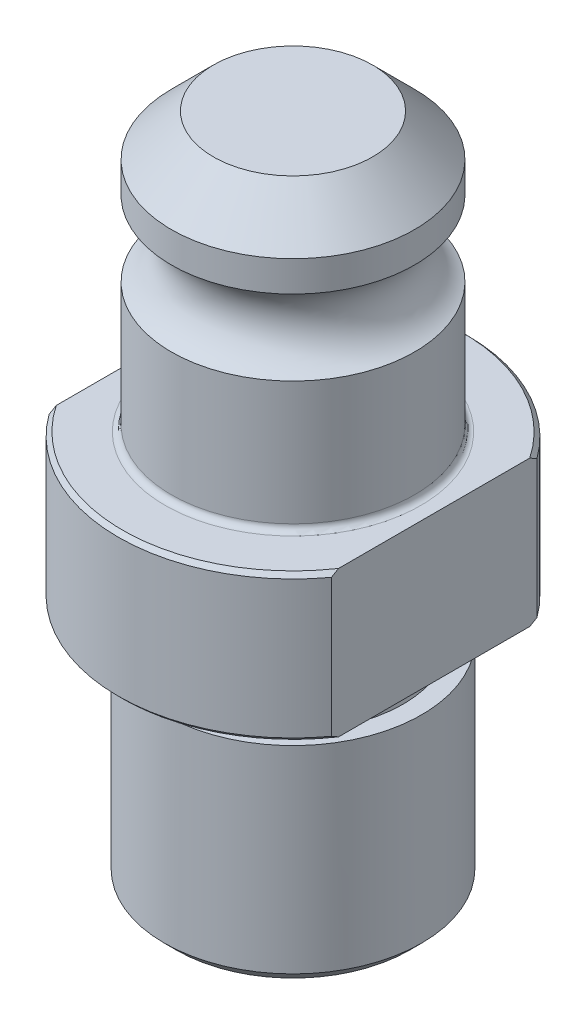
ISO-10303-21;
HEADER;
FILE_DESCRIPTION(('STEP AP214'),'2;1');
FILE_NAME('part.step','',(''),(''),'','','');
FILE_SCHEMA(('AUTOMOTIVE_DESIGN { 1 0 10303 214 1 1 1 1 }'));
ENDSEC;
DATA;
#1=APPLICATION_CONTEXT('core data for automotive mechanical design processes');
#2=APPLICATION_PROTOCOL_DEFINITION('international standard','automotive_design',2000,#1);
#3=PRODUCT_CONTEXT('',#1,'mechanical');
#4=PRODUCT('Part','Part','',(#3));
#5=PRODUCT_RELATED_PRODUCT_CATEGORY('part','',(#4));
#6=PRODUCT_DEFINITION_FORMATION('','',#4);
#7=PRODUCT_DEFINITION_CONTEXT('part definition',#1,'design');
#8=PRODUCT_DEFINITION('design','',#6,#7);
#9=PRODUCT_DEFINITION_SHAPE('','',#8);
#10=(LENGTH_UNIT() NAMED_UNIT(*) SI_UNIT(.MILLI.,.METRE.));
#11=(NAMED_UNIT(*) PLANE_ANGLE_UNIT() SI_UNIT($,.RADIAN.));
#12=(NAMED_UNIT(*) SI_UNIT($,.STERADIAN.) SOLID_ANGLE_UNIT());
#13=UNCERTAINTY_MEASURE_WITH_UNIT(LENGTH_MEASURE(1.E-05),#10,'distance_accuracy_value','');
#14=(GEOMETRIC_REPRESENTATION_CONTEXT(3) GLOBAL_UNCERTAINTY_ASSIGNED_CONTEXT((#13)) GLOBAL_UNIT_ASSIGNED_CONTEXT((#10,
#11,#12)) REPRESENTATION_CONTEXT('',''));
#15=CARTESIAN_POINT('',(0.,0.,0.));
#16=DIRECTION('',(0.,0.,1.));
#17=DIRECTION('',(1.,0.,0.));
#18=AXIS2_PLACEMENT_3D('',#15,#16,#17);
#19=CARTESIAN_POINT('',(0.,-30.2514,0.));
#20=DIRECTION('',(0.,1.,0.));
#21=DIRECTION('',(-1.,0.,0.));
#22=AXIS2_PLACEMENT_3D('',#19,#20,#21);
#23=CYLINDRICAL_SURFACE('',#22,21.5519);
#24=DIRECTION('',(0.,1.,0.));
#25=VECTOR('',#24,1.);
#26=CARTESIAN_POINT('',(-17.4244,-30.2514,-12.6836382103086));
#27=LINE('',#26,#25);
#28=CARTESIAN_POINT('',(-17.4244,0.507999999999992,-12.6836382103086));
#29=VERTEX_POINT('',#28);
#30=CARTESIAN_POINT('',(-17.4244,17.5006,-12.6836382103086));
#31=VERTEX_POINT('',#30);
#32=EDGE_CURVE('E178',#29,#31,#27,.T.);
#33=ORIENTED_EDGE('',*,*,#32,.T.);
#34=CARTESIAN_POINT('',(0.,17.5006,0.));
#35=DIRECTION('',(0.,1.,0.));
#36=DIRECTION('',(-1.,0.,0.));
#37=AXIS2_PLACEMENT_3D('',#34,#35,#36);
#38=CIRCLE('',#37,21.5519);
#39=CARTESIAN_POINT('',(17.4244,17.5006,-12.6836382103086));
#40=VERTEX_POINT('',#39);
#41=EDGE_CURVE('E196',#31,#40,#38,.F.);
#42=ORIENTED_EDGE('',*,*,#41,.T.);
#43=DIRECTION('',(0.,1.,0.));
#44=VECTOR('',#43,1.);
#45=CARTESIAN_POINT('',(17.4244,-30.2514,-12.6836382103086));
#46=LINE('',#45,#44);
#47=CARTESIAN_POINT('',(17.4244,0.507999999999997,-12.6836382103086));
#48=VERTEX_POINT('',#47);
#49=EDGE_CURVE('E158',#48,#40,#46,.T.);
#50=ORIENTED_EDGE('',*,*,#49,.F.);
#51=CARTESIAN_POINT('',(0.,0.507999999999995,0.));
#52=DIRECTION('',(0.,-1.,0.));
#53=DIRECTION('',(1.,0.,0.));
#54=AXIS2_PLACEMENT_3D('',#51,#52,#53);
#55=CIRCLE('',#54,21.5519);
#56=EDGE_CURVE('E199',#48,#29,#55,.F.);
#57=ORIENTED_EDGE('',*,*,#56,.T.);
#58=EDGE_LOOP('',(#33,#42,#50,#57));
#59=FACE_BOUND('',#58,.T.);
#60=ADVANCED_FACE('F31',(#59),#23,.T.);
#61=CARTESIAN_POINT('',(0.,0.507999999999995,0.));
#62=DIRECTION('',(0.,1.,0.));
#63=DIRECTION('',(-1.,0.,0.));
#64=AXIS2_PLACEMENT_3D('',#61,#62,#63);
#65=CONICAL_SURFACE('',#64,21.5519,0.785398163397452);
#66=CARTESIAN_POINT('',(-17.4244,11.8563224222257,-27.9072556886543));
#67=CARTESIAN_POINT('',(-17.4244,11.497446006332,-27.4841518148416));
#68=CARTESIAN_POINT('',(-17.4244,11.139879644986,-27.059931970063));
#69=CARTESIAN_POINT('',(-17.4244,10.4277519906731,-26.208962474076));
#70=CARTESIAN_POINT('',(-17.4244,10.0731907634447,-25.782212767871));
#71=CARTESIAN_POINT('',(-17.4244,9.36727721205871,-24.9256653041818));
#72=CARTESIAN_POINT('',(-17.4244,9.01592678809782,-24.4958659793081));
#73=CARTESIAN_POINT('',(-17.4244,8.31712286191661,-23.6331118998288));
#74=CARTESIAN_POINT('',(-17.4244,7.9696693424061,-23.2001571592374));
#75=CARTESIAN_POINT('',(-17.4244,7.26853068632844,-22.3172184878341));
#76=CARTESIAN_POINT('',(-17.4244,6.91498625041696,-21.8671227074988));
#77=CARTESIAN_POINT('',(-17.4244,6.21341288121156,-20.9626541434757));
#78=CARTESIAN_POINT('',(-17.4244,5.86538390025772,-20.5082813967999));
#79=CARTESIAN_POINT('',(-17.4244,5.17585017861483,-19.5947783456982));
#80=CARTESIAN_POINT('',(-17.4244,4.83434387378793,-19.1356492236394));
#81=CARTESIAN_POINT('',(-17.4244,4.15890858246452,-18.211841436366));
#82=CARTESIAN_POINT('',(-17.4244,3.82497959215728,-17.7471627739425));
#83=CARTESIAN_POINT('',(-17.4244,3.16533477494923,-16.8103609962737));
#84=CARTESIAN_POINT('',(-17.4244,2.83964012963573,-16.3382229331174));
#85=CARTESIAN_POINT('',(-17.4244,2.19905179151465,-15.3866471116477));
#86=CARTESIAN_POINT('',(-17.4244,1.88415823414789,-14.9072092619069));
#87=CARTESIAN_POINT('',(-17.4244,1.26711182380443,-13.9395340283393));
#88=CARTESIAN_POINT('',(-17.4244,0.964971367214826,-13.4512887126054));
#89=CARTESIAN_POINT('',(-17.4244,0.37657396577687,-12.4652923623447));
#90=CARTESIAN_POINT('',(-17.4244,0.0903166671764195,-11.967541539858));
#91=CARTESIAN_POINT('',(-17.4244,-0.45947101833788,-10.9672913194747));
#92=CARTESIAN_POINT('',(-17.4244,-0.723231444322966,-10.4649190472675));
#93=CARTESIAN_POINT('',(-17.4244,-1.22751772391395,-9.44849321809179));
#94=CARTESIAN_POINT('',(-17.4244,-1.46804082252396,-8.9344382849403));
#95=CARTESIAN_POINT('',(-17.4244,-1.92013421666309,-7.89476584941241));
#96=CARTESIAN_POINT('',(-17.4244,-2.1317572927396,-7.3691715168402));
#97=CARTESIAN_POINT('',(-17.4244,-2.52034116062086,-6.30536280352668));
#98=CARTESIAN_POINT('',(-17.4244,-2.69731065152923,-5.76715162808017));
#99=CARTESIAN_POINT('',(-17.4244,-3.01419316914321,-4.66339205171976));
#100=CARTESIAN_POINT('',(-17.4244,-3.15293624851997,-4.09749979522092));
#101=CARTESIAN_POINT('',(-17.4244,-3.32282573265757,-3.24117987958009));
#102=CARTESIAN_POINT('',(-17.4244,-3.37308749721147,-2.95446694268564));
#103=CARTESIAN_POINT('',(-17.4244,-3.46014055200824,-2.37901053551717));
#104=CARTESIAN_POINT('',(-17.4244,-3.49693335777404,-2.0902672974206));
#105=CARTESIAN_POINT('',(-17.4244,-3.55634967000912,-1.51230385292326));
#106=CARTESIAN_POINT('',(-17.4244,-3.57902033055391,-1.22308850209392));
#107=CARTESIAN_POINT('',(-17.4244,-3.6100052210744,-0.643886741036588));
#108=CARTESIAN_POINT('',(-17.4244,-3.61831954491647,-0.353900335862411));
#109=CARTESIAN_POINT('',(-17.4244,-3.62044623064542,0.226131262489977));
#110=CARTESIAN_POINT('',(-17.4244,-3.61425832166505,0.516176456665052));
#111=CARTESIAN_POINT('',(-17.4244,-3.58748888182636,1.09559842862056));
#112=CARTESIAN_POINT('',(-17.4244,-3.56690731437,1.38497520469955));
#113=CARTESIAN_POINT('',(-17.4244,-3.51182835998662,1.96102620577023));
#114=CARTESIAN_POINT('',(-17.4244,-3.47739681865903,2.24770674043548));
#115=CARTESIAN_POINT('',(-17.4244,-3.39517930485804,2.81915927816775));
#116=CARTESIAN_POINT('',(-17.4244,-3.34739165154914,3.10393103639785));
#117=CARTESIAN_POINT('',(-17.4244,-3.18503753946257,3.95457837281194));
#118=CARTESIAN_POINT('',(-17.4244,-3.05146866327099,4.51689888066977));
#119=CARTESIAN_POINT('',(-17.4244,-2.73976586254644,5.63208226357504));
#120=CARTESIAN_POINT('',(-17.4244,-2.56139535612586,6.18487773297777));
#121=CARTESIAN_POINT('',(-17.4244,-2.26625758874674,7.00392694053045));
#122=CARTESIAN_POINT('',(-17.4244,-2.16327906237169,7.27525785135747));
#123=CARTESIAN_POINT('',(-17.4244,-1.9489641303344,7.8146080653739));
#124=CARTESIAN_POINT('',(-17.4244,-1.83762760776311,8.08262732217985));
#125=CARTESIAN_POINT('',(-17.4244,-1.55616479753812,8.73399626750943));
#126=CARTESIAN_POINT('',(-17.4244,-1.38193168034421,9.11557147169098));
#127=CARTESIAN_POINT('',(-17.4244,-1.01989436704125,9.87225797588889));
#128=CARTESIAN_POINT('',(-17.4244,-0.832088274735934,10.2473683636449));
#129=CARTESIAN_POINT('',(-17.4244,-0.444713116749871,10.9917169801935));
#130=CARTESIAN_POINT('',(-17.4244,-0.245137451033026,11.3609517638897));
#131=CARTESIAN_POINT('',(-17.4244,0.164045088317299,12.093783900487));
#132=CARTESIAN_POINT('',(-17.4244,0.373651557461583,12.4573814799252));
#133=CARTESIAN_POINT('',(-17.4244,0.802020510182071,13.1802696301036));
#134=CARTESIAN_POINT('',(-17.4244,1.02080307556912,13.5395482749554));
#135=CARTESIAN_POINT('',(-17.4244,1.46591162108949,14.2534094481008));
#136=CARTESIAN_POINT('',(-17.4244,1.69223791099798,14.6079917827077));
#137=CARTESIAN_POINT('',(-17.4244,2.3808681316202,15.665139713894));
#138=CARTESIAN_POINT('',(-17.4244,2.852961361547,16.3613361968847));
#139=CARTESIAN_POINT('',(-17.4244,3.81885958013867,17.7423552936568));
#140=CARTESIAN_POINT('',(-17.4244,4.31274055153405,18.4271243620366));
#141=CARTESIAN_POINT('',(-17.4244,5.31614051213202,19.7851281076276));
#142=CARTESIAN_POINT('',(-17.4244,5.82566026285449,20.4583622206566));
#143=CARTESIAN_POINT('',(-17.4244,6.85643217899756,21.7944750481677));
#144=CARTESIAN_POINT('',(-17.4244,7.37766959079,22.4573651798632));
#145=CARTESIAN_POINT('',(-17.4244,8.43003467542524,23.7752050796958));
#146=CARTESIAN_POINT('',(-17.4244,8.96116206570667,24.4301550738064));
#147=CARTESIAN_POINT('',(-17.4244,9.69140260794962,25.3193086968898));
#148=CARTESIAN_POINT('',(-17.4244,9.88701653820471,25.5563967378411));
#149=CARTESIAN_POINT('',(-17.4244,10.27926705447,26.0297648031054));
#150=CARTESIAN_POINT('',(-17.4244,10.475903737833,26.2660447468137));
#151=CARTESIAN_POINT('',(-17.4244,10.8693491282346,26.736911158722));
#152=CARTESIAN_POINT('',(-17.4244,11.0661542284344,26.9715006422416));
#153=CARTESIAN_POINT('',(-17.4244,11.4606124879376,27.4399261954128));
#154=CARTESIAN_POINT('',(-17.4244,11.6582655620252,27.6737623368181));
#155=CARTESIAN_POINT('',(-17.4244,11.8563224222257,27.9072556886543));
#156=B_SPLINE_CURVE_WITH_KNOTS('',3,(#66,#67,#68,#69,#70,#71,#72,#73,#74,#75,#76,#77,#78,#79,
#80,#81,#82,#83,#84,#85,#86,#87,#88,#89,#90,#91,#92,#93,#94,#95,#96,#97,#98,#99,#100,#101,#102,
#103,#104,#105,#106,#107,#108,#109,#110,#111,#112,#113,#114,#115,#116,#117,#118,#119,#120,#121,
#122,#123,#124,#125,#126,#127,#128,#129,#130,#131,#132,#133,#134,#135,#136,#137,#138,#139,#140,
#141,#142,#143,#144,#145,#146,#147,#148,#149,#150,#151,#152,#153,#154,#155),.UNSPECIFIED.,.F.,
.F.,(4,2,2,2,2,2,2,2,2,2,2,2,2,2,2,2,2,2,2,2,2,2,2,2,2,2,2,2,2,2,2,2,2,2,2,2,2,2,2,2,2,2,2,2,4),
(0.,1.66441931631384,3.32887494904897,4.99425899305805,6.65963564498762,8.37663657483053,
10.0936226597008,11.8101917065555,13.5267598901049,15.2473684181029,16.9679985138807,
18.690264308084,20.4124917283127,22.1142110349574,23.8161318489058,25.5149016196488,
27.2132443992937,28.9589100358366,29.8318994186153,30.7047905426938,31.5747512225242,
32.4447062142491,33.3146774547959,34.1846509073825,35.0505363109151,35.9165307332084,
37.6481805786678,39.3891743258667,40.2597050354752,41.1302479240664,42.3883378760547,
43.6466039290213,44.9055824174467,46.164510180644,47.4263537405624,48.6882491807603,
51.2112361275288,53.7438515187595,56.2765904302654,58.8063015872604,61.3359405797659,
62.2580453943,63.1802396489347,64.0988671359141,65.0174043738347),.UNSPECIFIED.);
#157=CARTESIAN_POINT('',(-17.4244,0.,-11.7998310093832));
#158=VERTEX_POINT('',#157);
#159=EDGE_CURVE('E179',#29,#158,#156,.T.);
#160=ORIENTED_EDGE('',*,*,#159,.F.);
#161=ORIENTED_EDGE('',*,*,#56,.F.);
#162=CARTESIAN_POINT('',(17.4244,11.8563224222256,27.9072556886542));
#163=CARTESIAN_POINT('',(17.4244,11.497446006332,27.4841518148416));
#164=CARTESIAN_POINT('',(17.4244,11.139879644986,27.059931970063));
#165=CARTESIAN_POINT('',(17.4244,10.4277519906731,26.208962474076));
#166=CARTESIAN_POINT('',(17.4244,10.0731907634447,25.7822127678709));
#167=CARTESIAN_POINT('',(17.4244,9.3672772120587,24.9256653041818));
#168=CARTESIAN_POINT('',(17.4244,9.0159267880978,24.4958659793081));
#169=CARTESIAN_POINT('',(17.4244,8.3171228619166,23.6331118998287));
#170=CARTESIAN_POINT('',(17.4244,7.96966934240609,23.2001571592374));
#171=CARTESIAN_POINT('',(17.4244,7.26853068632842,22.3172184878341));
#172=CARTESIAN_POINT('',(17.4244,6.91498625041694,21.8671227074988));
#173=CARTESIAN_POINT('',(17.4244,6.21341288121154,20.9626541434757));
#174=CARTESIAN_POINT('',(17.4244,5.86538390025771,20.5082813967999));
#175=CARTESIAN_POINT('',(17.4244,5.17585017861481,19.5947783456982));
#176=CARTESIAN_POINT('',(17.4244,4.83434387378791,19.1356492236394));
#177=CARTESIAN_POINT('',(17.4244,4.1589085824645,18.211841436366));
#178=CARTESIAN_POINT('',(17.4244,3.82497959215725,17.7471627739425));
#179=CARTESIAN_POINT('',(17.4244,3.16533477494921,16.8103609962736));
#180=CARTESIAN_POINT('',(17.4244,2.83964012963571,16.3382229331173));
#181=CARTESIAN_POINT('',(17.4244,2.19905179151463,15.3866471116476));
#182=CARTESIAN_POINT('',(17.4244,1.88415823414787,14.9072092619069));
#183=CARTESIAN_POINT('',(17.4244,1.26711182380441,13.9395340283392));
#184=CARTESIAN_POINT('',(17.4244,0.964971367214808,13.4512887126054));
#185=CARTESIAN_POINT('',(17.4244,0.376573965776851,12.4652923623446));
#186=CARTESIAN_POINT('',(17.4244,0.0903166671763986,11.9675415398579));
#187=CARTESIAN_POINT('',(17.4244,-0.4594710183379,10.9672913194746));
#188=CARTESIAN_POINT('',(17.4244,-0.723231444322983,10.4649190472675));
#189=CARTESIAN_POINT('',(17.4244,-1.22751772391396,9.44849321809174));
#190=CARTESIAN_POINT('',(17.4244,-1.46804082252397,8.93443828494024));
#191=CARTESIAN_POINT('',(17.4244,-1.9201342166631,7.89476584941236));
#192=CARTESIAN_POINT('',(17.4244,-2.13175729273961,7.36917151684015));
#193=CARTESIAN_POINT('',(17.4244,-2.52034116062087,6.30536280352662));
#194=CARTESIAN_POINT('',(17.4244,-2.69731065152924,5.76715162808011));
#195=CARTESIAN_POINT('',(17.4244,-3.01419316914322,4.6633920517197));
#196=CARTESIAN_POINT('',(17.4244,-3.15293624851997,4.09749979522086));
#197=CARTESIAN_POINT('',(17.4244,-3.32282573265757,3.24117987958003));
#198=CARTESIAN_POINT('',(17.4244,-3.37308749721147,2.95446694268558));
#199=CARTESIAN_POINT('',(17.4244,-3.46014055200824,2.37901053551711));
#200=CARTESIAN_POINT('',(17.4244,-3.49693335777404,2.09026729742054));
#201=CARTESIAN_POINT('',(17.4244,-3.55634967000912,1.5123038529232));
#202=CARTESIAN_POINT('',(17.4244,-3.5790203305539,1.22308850209386));
#203=CARTESIAN_POINT('',(17.4244,-3.61000522107439,0.643886741036524));
#204=CARTESIAN_POINT('',(17.4244,-3.61831954491645,0.353900335862348));
#205=CARTESIAN_POINT('',(17.4244,-3.62044623064541,-0.226131262490039));
#206=CARTESIAN_POINT('',(17.4244,-3.61425832166504,-0.516176456665115));
#207=CARTESIAN_POINT('',(17.4244,-3.58748888182634,-1.09559842862062));
#208=CARTESIAN_POINT('',(17.4244,-3.56690731436998,-1.38497520469961));
#209=CARTESIAN_POINT('',(17.4244,-3.5118283599866,-1.96102620577029));
#210=CARTESIAN_POINT('',(17.4244,-3.47739681865901,-2.24770674043554));
#211=CARTESIAN_POINT('',(17.4244,-3.39517930485802,-2.8191592781678));
#212=CARTESIAN_POINT('',(17.4244,-3.34739165154912,-3.1039310363979));
#213=CARTESIAN_POINT('',(17.4244,-3.18503753946255,-3.95457837281199));
#214=CARTESIAN_POINT('',(17.4244,-3.05146866327096,-4.51689888066981));
#215=CARTESIAN_POINT('',(17.4244,-2.73976586254641,-5.63208226357508));
#216=CARTESIAN_POINT('',(17.4244,-2.56139535612583,-6.18487773297782));
#217=CARTESIAN_POINT('',(17.4244,-2.26625758874671,-7.0039269405305));
#218=CARTESIAN_POINT('',(17.4244,-2.16327906237166,-7.27525785135751));
#219=CARTESIAN_POINT('',(17.4244,-1.94896413033437,-7.81460806537395));
#220=CARTESIAN_POINT('',(17.4244,-1.83762760776308,-8.08262732217989));
#221=CARTESIAN_POINT('',(17.4244,-1.55616479753809,-8.73399626750947));
#222=CARTESIAN_POINT('',(17.4244,-1.38193168034418,-9.11557147169102));
#223=CARTESIAN_POINT('',(17.4244,-1.01989436704122,-9.87225797588894));
#224=CARTESIAN_POINT('',(17.4244,-0.832088274735892,-10.247368363645));
#225=CARTESIAN_POINT('',(17.4244,-0.444713116749825,-10.9917169801935));
#226=CARTESIAN_POINT('',(17.4244,-0.245137451032979,-11.3609517638898));
#227=CARTESIAN_POINT('',(17.4244,0.164045088317348,-12.0937839004871));
#228=CARTESIAN_POINT('',(17.4244,0.373651557461635,-12.4573814799252));
#229=CARTESIAN_POINT('',(17.4244,0.802020510182127,-13.1802696301036));
#230=CARTESIAN_POINT('',(17.4244,1.02080307556918,-13.5395482749555));
#231=CARTESIAN_POINT('',(17.4244,1.46591162108956,-14.2534094481008));
#232=CARTESIAN_POINT('',(17.4244,1.69223791099805,-14.6079917827077));
#233=CARTESIAN_POINT('',(17.4244,2.38086813162027,-15.6651397138941));
#234=CARTESIAN_POINT('',(17.4244,2.85296136154708,-16.3613361968848));
#235=CARTESIAN_POINT('',(17.4244,3.81885958013877,-17.7423552936569));
#236=CARTESIAN_POINT('',(17.4244,4.31274055153415,-18.4271243620367));
#237=CARTESIAN_POINT('',(17.4244,5.31614051213213,-19.7851281076277));
#238=CARTESIAN_POINT('',(17.4244,5.82566026285461,-20.4583622206568));
#239=CARTESIAN_POINT('',(17.4244,6.85643217899769,-21.7944750481679));
#240=CARTESIAN_POINT('',(17.4244,7.37766959079013,-22.4573651798634));
#241=CARTESIAN_POINT('',(17.4244,8.43003467542539,-23.775205079696));
#242=CARTESIAN_POINT('',(17.4244,8.96116206570682,-24.4301550738065));
#243=CARTESIAN_POINT('',(17.4244,9.69140260794976,-25.31930869689));
#244=CARTESIAN_POINT('',(17.4244,9.88701653820484,-25.5563967378413));
#245=CARTESIAN_POINT('',(17.4244,10.2792670544702,-26.0297648031055));
#246=CARTESIAN_POINT('',(17.4244,10.4759037378331,-26.2660447468138));
#247=CARTESIAN_POINT('',(17.4244,10.8693491282347,-26.7369111587221));
#248=CARTESIAN_POINT('',(17.4244,11.0661542284345,-26.9715006422417));
#249=CARTESIAN_POINT('',(17.4244,11.4606124879376,-27.4399261954128));
#250=CARTESIAN_POINT('',(17.4244,11.6582655620252,-27.6737623368181));
#251=CARTESIAN_POINT('',(17.4244,11.8563224222256,-27.9072556886542));
#252=B_SPLINE_CURVE_WITH_KNOTS('',3,(#162,#163,#164,#165,#166,#167,#168,#169,#170,#171,#172,
#173,#174,#175,#176,#177,#178,#179,#180,#181,#182,#183,#184,#185,#186,#187,#188,#189,#190,#191,
#192,#193,#194,#195,#196,#197,#198,#199,#200,#201,#202,#203,#204,#205,#206,#207,#208,#209,#210,
#211,#212,#213,#214,#215,#216,#217,#218,#219,#220,#221,#222,#223,#224,#225,#226,#227,#228,#229,
#230,#231,#232,#233,#234,#235,#236,#237,#238,#239,#240,#241,#242,#243,#244,#245,#246,#247,#248,
#249,#250,#251),.UNSPECIFIED.,.F.,.F.,(4,2,2,2,2,2,2,2,2,2,2,2,2,2,2,2,2,2,2,2,2,2,2,2,2,2,2,2,
2,2,2,2,2,2,2,2,2,2,2,2,2,2,2,2,4),(0.,1.66441931631384,3.32887494904897,4.99425899305805,
6.65963564498762,8.37663657483053,10.0936226597008,11.8101917065555,13.5267598901049,
15.2473684181029,16.9679985138807,18.690264308084,20.4124917283128,22.1142110349574,
23.8161318489058,25.5149016196488,27.2132443992937,28.9589100358367,29.8318994186153,
30.7047905426938,31.5747512225242,32.4447062142491,33.3146774547959,34.1846509073825,
35.0505363109151,35.9165307332084,37.6481805786678,39.3891743258667,40.2597050354752,
41.1302479240664,42.3883378760546,43.6466039290213,44.9055824174467,46.164510180644,
47.4263537405625,48.6882491807604,51.2112361275289,53.7438515187596,56.2765904302655,
58.8063015872605,61.335940579766,62.2580453943001,63.1802396489348,64.0988671359141,
65.0174043738346),.UNSPECIFIED.);
#253=CARTESIAN_POINT('',(17.4244,0.,-11.7998310093831));
#254=VERTEX_POINT('',#253);
#255=EDGE_CURVE('E149',#254,#48,#252,.T.);
#256=ORIENTED_EDGE('',*,*,#255,.F.);
#257=CARTESIAN_POINT('',(0.,0.,0.));
#258=DIRECTION('',(0.,-1.,0.));
#259=DIRECTION('',(1.,0.,0.));
#260=AXIS2_PLACEMENT_3D('',#257,#258,#259);
#261=CIRCLE('',#260,21.0439);
#262=EDGE_CURVE('E116',#158,#254,#261,.T.);
#263=ORIENTED_EDGE('',*,*,#262,.F.);
#264=EDGE_LOOP('',(#160,#161,#256,#263));
#265=FACE_BOUND('',#264,.T.);
#266=ADVANCED_FACE('F166',(#265),#65,.T.);
#267=CARTESIAN_POINT('',(0.,18.0086,0.));
#268=DIRECTION('',(0.,-1.,0.));
#269=DIRECTION('',(1.,0.,0.));
#270=AXIS2_PLACEMENT_3D('',#267,#268,#269);
#271=CONICAL_SURFACE('',#270,21.0439,0.785398163397438);
#272=CARTESIAN_POINT('',(-17.4244,6.15227757777399,27.9072556886543));
#273=CARTESIAN_POINT('',(-17.4244,6.51115399366764,27.4841518148416));
#274=CARTESIAN_POINT('',(-17.4244,6.86872035501363,27.0599319700631));
#275=CARTESIAN_POINT('',(-17.4244,7.58084800932659,26.208962474076));
#276=CARTESIAN_POINT('',(-17.4244,7.93540923655492,25.782212767871));
#277=CARTESIAN_POINT('',(-17.4244,8.64132278794095,24.9256653041819));
#278=CARTESIAN_POINT('',(-17.4244,8.99267321190185,24.4958659793082));
#279=CARTESIAN_POINT('',(-17.4244,9.69147713808306,23.6331118998289));
#280=CARTESIAN_POINT('',(-17.4244,10.0389306575936,23.2001571592375));
#281=CARTESIAN_POINT('',(-17.4244,10.7400693136712,22.3172184878342));
#282=CARTESIAN_POINT('',(-17.4244,11.0936137495827,21.867122707499));
#283=CARTESIAN_POINT('',(-17.4244,11.7951871187881,20.9626541434758));
#284=CARTESIAN_POINT('',(-17.4244,12.143216099742,20.5082813968001));
#285=CARTESIAN_POINT('',(-17.4244,12.8327498213849,19.5947783456984));
#286=CARTESIAN_POINT('',(-17.4244,13.1742561262118,19.1356492236396));
#287=CARTESIAN_POINT('',(-17.4244,13.8496914175352,18.2118414363662));
#288=CARTESIAN_POINT('',(-17.4244,14.1836204078424,17.7471627739427));
#289=CARTESIAN_POINT('',(-17.4244,14.8432652250505,16.8103609962739));
#290=CARTESIAN_POINT('',(-17.4244,15.168959870364,16.3382229331176));
#291=CARTESIAN_POINT('',(-17.4244,15.8095482084851,15.3866471116479));
#292=CARTESIAN_POINT('',(-17.4244,16.1244417658518,14.9072092619072));
#293=CARTESIAN_POINT('',(-17.4244,16.7414881761953,13.9395340283396));
#294=CARTESIAN_POINT('',(-17.4244,17.0436286327849,13.4512887126058));
#295=CARTESIAN_POINT('',(-17.4244,17.6320260342229,12.465292362345));
#296=CARTESIAN_POINT('',(-17.4244,17.9182833328233,11.9675415398584));
#297=CARTESIAN_POINT('',(-17.4244,18.4680710183376,10.9672913194751));
#298=CARTESIAN_POINT('',(-17.4244,18.7318314443227,10.464919047268));
#299=CARTESIAN_POINT('',(-17.4244,19.2361177239137,9.44849321809224));
#300=CARTESIAN_POINT('',(-17.4244,19.4766408225238,8.93443828494075));
#301=CARTESIAN_POINT('',(-17.4244,19.9287342166629,7.8947658494129));
#302=CARTESIAN_POINT('',(-17.4244,20.1403572927394,7.3691715168407));
#303=CARTESIAN_POINT('',(-17.4244,20.5289411606207,6.3053628035272));
#304=CARTESIAN_POINT('',(-17.4244,20.7059106515291,5.7671516280807));
#305=CARTESIAN_POINT('',(-17.4244,21.0227931691431,4.66339205172031));
#306=CARTESIAN_POINT('',(-17.4244,21.1615362485199,4.09749979522149));
#307=CARTESIAN_POINT('',(-17.4244,21.3314257326575,3.24117987958069));
#308=CARTESIAN_POINT('',(-17.4244,21.3816874972114,2.95446694268624));
#309=CARTESIAN_POINT('',(-17.4244,21.4687405520082,2.37901053551778));
#310=CARTESIAN_POINT('',(-17.4244,21.505533357774,2.09026729742122));
#311=CARTESIAN_POINT('',(-17.4244,21.5649496700091,1.5123038529239));
#312=CARTESIAN_POINT('',(-17.4244,21.5876203305539,1.22308850209456));
#313=CARTESIAN_POINT('',(-17.4244,21.6186052210744,0.643886741037241));
#314=CARTESIAN_POINT('',(-17.4244,21.6269195449165,0.353900335863071));
#315=CARTESIAN_POINT('',(-17.4244,21.6290462306455,-0.226131262489305));
#316=CARTESIAN_POINT('',(-17.4244,21.6228583216651,-0.516176456664377));
#317=CARTESIAN_POINT('',(-17.4244,21.5960888818265,-1.09559842861987));
#318=CARTESIAN_POINT('',(-17.4244,21.5755073143701,-1.38497520469886));
#319=CARTESIAN_POINT('',(-17.4244,21.5204283599868,-1.96102620576953));
#320=CARTESIAN_POINT('',(-17.4244,21.4859968186592,-2.24770674043478));
#321=CARTESIAN_POINT('',(-17.4244,21.4037793048582,-2.81915927816704));
#322=CARTESIAN_POINT('',(-17.4244,21.3559916515493,-3.10393103639714));
#323=CARTESIAN_POINT('',(-17.4244,21.1936375394628,-3.95457837281121));
#324=CARTESIAN_POINT('',(-17.4244,21.0600686632712,-4.51689888066904));
#325=CARTESIAN_POINT('',(-17.4244,20.7483658625467,-5.6320822635743));
#326=CARTESIAN_POINT('',(-17.4244,20.5699953561261,-6.18487773297703));
#327=CARTESIAN_POINT('',(-17.4244,20.2748575887471,-7.00392694052971));
#328=CARTESIAN_POINT('',(-17.4244,20.171879062372,-7.27525785135672));
#329=CARTESIAN_POINT('',(-17.4244,19.9575641303347,-7.81460806537315));
#330=CARTESIAN_POINT('',(-17.4244,19.8462276077635,-8.08262732217909));
#331=CARTESIAN_POINT('',(-17.4244,19.5647647975385,-8.73399626750861));
#332=CARTESIAN_POINT('',(-17.4244,19.3905316803446,-9.1155714716901));
#333=CARTESIAN_POINT('',(-17.4244,19.0284943670417,-9.8722579758879));
#334=CARTESIAN_POINT('',(-17.4244,18.8406882747365,-10.2473683636439));
#335=CARTESIAN_POINT('',(-17.4244,18.4533131167505,-10.9917169801923));
#336=CARTESIAN_POINT('',(-17.4244,18.2537374510337,-11.3609517638885));
#337=CARTESIAN_POINT('',(-17.4244,17.8445549116834,-12.0937839004857));
#338=CARTESIAN_POINT('',(-17.4244,17.6349484425392,-12.4573814799238));
#339=CARTESIAN_POINT('',(-17.4244,17.2065794898188,-13.1802696301021));
#340=CARTESIAN_POINT('',(-17.4244,16.9877969244318,-13.5395482749539));
#341=CARTESIAN_POINT('',(-17.4244,16.5426883789115,-14.2534094480991));
#342=CARTESIAN_POINT('',(-17.4244,16.316362089003,-14.607991782706));
#343=CARTESIAN_POINT('',(-17.4244,15.6277318683809,-15.6651397138921));
#344=CARTESIAN_POINT('',(-17.4244,15.1556386384542,-16.3613361968828));
#345=CARTESIAN_POINT('',(-17.4244,14.1897404198627,-17.7423552936546));
#346=CARTESIAN_POINT('',(-17.4244,13.6958594484675,-18.4271243620343));
#347=CARTESIAN_POINT('',(-17.4244,12.6924594878696,-19.7851281076251));
#348=CARTESIAN_POINT('',(-17.4244,12.1829397371473,-20.4583622206541));
#349=CARTESIAN_POINT('',(-17.4244,11.1521678210044,-21.794475048165));
#350=CARTESIAN_POINT('',(-17.4244,10.630930409212,-22.4573651798604));
#351=CARTESIAN_POINT('',(-17.4244,9.57856532457696,-23.7752050796927));
#352=CARTESIAN_POINT('',(-17.4244,9.04743793429562,-24.4301550738032));
#353=CARTESIAN_POINT('',(-17.4244,8.31719739205253,-25.3193086968869));
#354=CARTESIAN_POINT('',(-17.4244,8.12158346179722,-25.5563967378384));
#355=CARTESIAN_POINT('',(-17.4244,7.72933294553143,-26.0297648031032));
#356=CARTESIAN_POINT('',(-17.4244,7.53269626216821,-26.2660447468118));
#357=CARTESIAN_POINT('',(-17.4244,7.13925087176616,-26.7369111587207));
#358=CARTESIAN_POINT('',(-17.4244,6.94244577156612,-26.9715006422406));
#359=CARTESIAN_POINT('',(-17.4244,6.54798751206255,-27.4399261954123));
#360=CARTESIAN_POINT('',(-17.4244,6.35033443797471,-27.6737623368178));
#361=CARTESIAN_POINT('',(-17.4244,6.15227757777399,-27.9072556886543));
#362=B_SPLINE_CURVE_WITH_KNOTS('',3,(#272,#273,#274,#275,#276,#277,#278,#279,#280,#281,#282,
#283,#284,#285,#286,#287,#288,#289,#290,#291,#292,#293,#294,#295,#296,#297,#298,#299,#300,#301,
#302,#303,#304,#305,#306,#307,#308,#309,#310,#311,#312,#313,#314,#315,#316,#317,#318,#319,#320,
#321,#322,#323,#324,#325,#326,#327,#328,#329,#330,#331,#332,#333,#334,#335,#336,#337,#338,#339,
#340,#341,#342,#343,#344,#345,#346,#347,#348,#349,#350,#351,#352,#353,#354,#355,#356,#357,#358,
#359,#360,#361),.UNSPECIFIED.,.F.,.F.,(4,2,2,2,2,2,2,2,2,2,2,2,2,2,2,2,2,2,2,2,2,2,2,2,2,2,2,2,
2,2,2,2,2,2,2,2,2,2,2,2,2,2,2,2,4),(0.,1.66441931631382,3.32887494904893,4.994258993058,
6.65963564498754,8.37663657483044,10.0936226597007,11.8101917065553,13.5267598901048,
15.2473684181027,16.9679985138805,18.6902643080838,20.4124917283125,22.1142110349571,
23.8161318489055,25.5149016196484,27.2132443992933,28.9589100358363,29.8318994186149,
30.7047905426933,31.5747512225238,32.4447062142487,33.3146774547954,34.184650907382,
35.0505363109146,35.9165307332079,37.6481805786673,39.3891743258661,40.2597050354746,
41.1302479240658,42.3883378760538,43.6466039290203,44.9055824174455,46.1645101806426,
47.4263537405608,48.6882491807585,51.2112361275266,53.7438515187569,56.2765904302624,
58.806301587257,61.3359405797621,62.2580453942972,63.180239648933,64.0988671359135,
65.0174043738351),.UNSPECIFIED.);
#363=CARTESIAN_POINT('',(-17.4244,17.5006,12.6836382103086));
#364=VERTEX_POINT('',#363);
#365=CARTESIAN_POINT('',(-17.4244,18.0086,11.7998310093831));
#366=VERTEX_POINT('',#365);
#367=EDGE_CURVE('E95',#364,#366,#362,.T.);
#368=ORIENTED_EDGE('',*,*,#367,.F.);
#369=CARTESIAN_POINT('',(17.4244,17.5006,12.6836382103086));
#370=VERTEX_POINT('',#369);
#371=EDGE_CURVE('E202',#370,#364,#38,.F.);
#372=ORIENTED_EDGE('',*,*,#371,.F.);
#373=CARTESIAN_POINT('',(17.4244,6.15227757777401,-27.9072556886542));
#374=CARTESIAN_POINT('',(17.4244,6.51115399366766,-27.4841518148416));
#375=CARTESIAN_POINT('',(17.4244,6.86872035501364,-27.059931970063));
#376=CARTESIAN_POINT('',(17.4244,7.5808480093266,-26.208962474076));
#377=CARTESIAN_POINT('',(17.4244,7.93540923655494,-25.782212767871));
#378=CARTESIAN_POINT('',(17.4244,8.64132278794097,-24.9256653041819));
#379=CARTESIAN_POINT('',(17.4244,8.99267321190186,-24.4958659793082));
#380=CARTESIAN_POINT('',(17.4244,9.69147713808307,-23.6331118998288));
#381=CARTESIAN_POINT('',(17.4244,10.0389306575936,-23.2001571592375));
#382=CARTESIAN_POINT('',(17.4244,10.7400693136713,-22.3172184878342));
#383=CARTESIAN_POINT('',(17.4244,11.0936137495827,-21.8671227074989));
#384=CARTESIAN_POINT('',(17.4244,11.7951871187881,-20.9626541434758));
#385=CARTESIAN_POINT('',(17.4244,12.143216099742,-20.5082813968));
#386=CARTESIAN_POINT('',(17.4244,12.8327498213849,-19.5947783456984));
#387=CARTESIAN_POINT('',(17.4244,13.1742561262118,-19.1356492236396));
#388=CARTESIAN_POINT('',(17.4244,13.8496914175352,-18.2118414363662));
#389=CARTESIAN_POINT('',(17.4244,14.1836204078424,-17.7471627739427));
#390=CARTESIAN_POINT('',(17.4244,14.8432652250505,-16.8103609962739));
#391=CARTESIAN_POINT('',(17.4244,15.168959870364,-16.3382229331176));
#392=CARTESIAN_POINT('',(17.4244,15.8095482084851,-15.3866471116479));
#393=CARTESIAN_POINT('',(17.4244,16.1244417658518,-14.9072092619072));
#394=CARTESIAN_POINT('',(17.4244,16.7414881761953,-13.9395340283396));
#395=CARTESIAN_POINT('',(17.4244,17.0436286327849,-13.4512887126057));
#396=CARTESIAN_POINT('',(17.4244,17.6320260342229,-12.465292362345));
#397=CARTESIAN_POINT('',(17.4244,17.9182833328233,-11.9675415398583));
#398=CARTESIAN_POINT('',(17.4244,18.4680710183377,-10.967291319475));
#399=CARTESIAN_POINT('',(17.4244,18.7318314443227,-10.4649190472679));
#400=CARTESIAN_POINT('',(17.4244,19.2361177239137,-9.4484932180922));
#401=CARTESIAN_POINT('',(17.4244,19.4766408225238,-8.93443828494072));
#402=CARTESIAN_POINT('',(17.4244,19.9287342166629,-7.89476584941286));
#403=CARTESIAN_POINT('',(17.4244,20.1403572927394,-7.36917151684067));
#404=CARTESIAN_POINT('',(17.4244,20.5289411606207,-6.30536280352717));
#405=CARTESIAN_POINT('',(17.4244,20.7059106515291,-5.76715162808067));
#406=CARTESIAN_POINT('',(17.4244,21.0227931691431,-4.66339205172028));
#407=CARTESIAN_POINT('',(17.4244,21.1615362485199,-4.09749979522146));
#408=CARTESIAN_POINT('',(17.4244,21.3314257326575,-3.24117987958065));
#409=CARTESIAN_POINT('',(17.4244,21.3816874972114,-2.95446694268621));
#410=CARTESIAN_POINT('',(17.4244,21.4687405520082,-2.37901053551775));
#411=CARTESIAN_POINT('',(17.4244,21.505533357774,-2.09026729742119));
#412=CARTESIAN_POINT('',(17.4244,21.5649496700091,-1.51230385292386));
#413=CARTESIAN_POINT('',(17.4244,21.5876203305539,-1.22308850209453));
#414=CARTESIAN_POINT('',(17.4244,21.6186052210744,-0.643886741037207));
#415=CARTESIAN_POINT('',(17.4244,21.6269195449165,-0.353900335863038));
#416=CARTESIAN_POINT('',(17.4244,21.6290462306455,0.226131262489338));
#417=CARTESIAN_POINT('',(17.4244,21.6228583216651,0.516176456664409));
#418=CARTESIAN_POINT('',(17.4244,21.5960888818265,1.0955984286199));
#419=CARTESIAN_POINT('',(17.4244,21.5755073143701,1.38497520469889));
#420=CARTESIAN_POINT('',(17.4244,21.5204283599867,1.96102620576956));
#421=CARTESIAN_POINT('',(17.4244,21.4859968186592,2.24770674043481));
#422=CARTESIAN_POINT('',(17.4244,21.4037793048582,2.81915927816707));
#423=CARTESIAN_POINT('',(17.4244,21.3559916515493,3.10393103639716));
#424=CARTESIAN_POINT('',(17.4244,21.1936375394628,3.95457837281124));
#425=CARTESIAN_POINT('',(17.4244,21.0600686632712,4.51689888066906));
#426=CARTESIAN_POINT('',(17.4244,20.7483658625467,5.63208226357432));
#427=CARTESIAN_POINT('',(17.4244,20.5699953561261,6.18487773297705));
#428=CARTESIAN_POINT('',(17.4244,20.274857588747,7.00392694052973));
#429=CARTESIAN_POINT('',(17.4244,20.171879062372,7.27525785135674));
#430=CARTESIAN_POINT('',(17.4244,19.9575641303347,7.81460806537317));
#431=CARTESIAN_POINT('',(17.4244,19.8462276077634,8.08262732217911));
#432=CARTESIAN_POINT('',(17.4244,19.5647647975385,8.73399626750863));
#433=CARTESIAN_POINT('',(17.4244,19.3905316803446,9.11557147169012));
#434=CARTESIAN_POINT('',(17.4244,19.0284943670417,9.87225797588792));
#435=CARTESIAN_POINT('',(17.4244,18.8406882747364,10.2473683636439));
#436=CARTESIAN_POINT('',(17.4244,18.4533131167504,10.9917169801923));
#437=CARTESIAN_POINT('',(17.4244,18.2537374510336,11.3609517638885));
#438=CARTESIAN_POINT('',(17.4244,17.8445549116834,12.0937839004857));
#439=CARTESIAN_POINT('',(17.4244,17.6349484425391,12.4573814799238));
#440=CARTESIAN_POINT('',(17.4244,17.2065794898187,13.1802696301021));
#441=CARTESIAN_POINT('',(17.4244,16.9877969244317,13.5395482749539));
#442=CARTESIAN_POINT('',(17.4244,16.5426883789114,14.2534094480992));
#443=CARTESIAN_POINT('',(17.4244,16.316362089003,14.607991782706));
#444=CARTESIAN_POINT('',(17.4244,15.6277318683809,15.6651397138922));
#445=CARTESIAN_POINT('',(17.4244,15.1556386384542,16.3613361968828));
#446=CARTESIAN_POINT('',(17.4244,14.1897404198627,17.7423552936547));
#447=CARTESIAN_POINT('',(17.4244,13.6958594484674,18.4271243620344));
#448=CARTESIAN_POINT('',(17.4244,12.6924594878696,19.7851281076252));
#449=CARTESIAN_POINT('',(17.4244,12.1829397371472,20.4583622206541));
#450=CARTESIAN_POINT('',(17.4244,11.1521678210043,21.794475048165));
#451=CARTESIAN_POINT('',(17.4244,10.630930409212,22.4573651798604));
#452=CARTESIAN_POINT('',(17.4244,9.57856532457689,23.7752050796928));
#453=CARTESIAN_POINT('',(17.4244,9.04743793429554,24.4301550738033));
#454=CARTESIAN_POINT('',(17.4244,8.31719739205246,25.3193086968869));
#455=CARTESIAN_POINT('',(17.4244,8.12158346179716,25.5563967378385));
#456=CARTESIAN_POINT('',(17.4244,7.72933294553138,26.0297648031033));
#457=CARTESIAN_POINT('',(17.4244,7.53269626216817,26.2660447468119));
#458=CARTESIAN_POINT('',(17.4244,7.13925087176613,26.7369111587207));
#459=CARTESIAN_POINT('',(17.4244,6.94244577156611,26.9715006422406));
#460=CARTESIAN_POINT('',(17.4244,6.54798751206255,27.4399261954123));
#461=CARTESIAN_POINT('',(17.4244,6.35033443797472,27.6737623368178));
#462=CARTESIAN_POINT('',(17.4244,6.15227757777401,27.9072556886542));
#463=B_SPLINE_CURVE_WITH_KNOTS('',3,(#373,#374,#375,#376,#377,#378,#379,#380,#381,#382,#383,
#384,#385,#386,#387,#388,#389,#390,#391,#392,#393,#394,#395,#396,#397,#398,#399,#400,#401,#402,
#403,#404,#405,#406,#407,#408,#409,#410,#411,#412,#413,#414,#415,#416,#417,#418,#419,#420,#421,
#422,#423,#424,#425,#426,#427,#428,#429,#430,#431,#432,#433,#434,#435,#436,#437,#438,#439,#440,
#441,#442,#443,#444,#445,#446,#447,#448,#449,#450,#451,#452,#453,#454,#455,#456,#457,#458,#459,
#460,#461,#462),.UNSPECIFIED.,.F.,.F.,(4,2,2,2,2,2,2,2,2,2,2,2,2,2,2,2,2,2,2,2,2,2,2,2,2,2,2,2,
2,2,2,2,2,2,2,2,2,2,2,2,2,2,2,2,4),(0.,1.66441931631381,3.32887494904893,4.994258993058,
6.65963564498755,8.37663657483044,10.0936226597007,11.8101917065553,13.5267598901048,
15.2473684181027,16.9679985138805,18.6902643080838,20.4124917283125,22.1142110349571,
23.8161318489055,25.5149016196484,27.2132443992933,28.9589100358363,29.8318994186149,
30.7047905426933,31.5747512225238,32.4447062142487,33.3146774547954,34.184650907382,
35.0505363109145,35.9165307332079,37.6481805786673,39.3891743258661,40.2597050354746,
41.1302479240658,42.3883378760538,43.6466039290203,44.9055824174455,46.1645101806426,
47.4263537405608,48.6882491807585,51.2112361275266,53.7438515187569,56.2765904302624,
58.806301587257,61.3359405797621,62.2580453942973,63.180239648933,64.0988671359135,
65.017404373835),.UNSPECIFIED.);
#464=CARTESIAN_POINT('',(17.4244,18.0086,11.7998310093831));
#465=VERTEX_POINT('',#464);
#466=EDGE_CURVE('E111',#465,#370,#463,.T.);
#467=ORIENTED_EDGE('',*,*,#466,.F.);
#468=CARTESIAN_POINT('',(0.,18.0086,0.));
#469=DIRECTION('',(0.,1.,0.));
#470=DIRECTION('',(-1.,0.,0.));
#471=AXIS2_PLACEMENT_3D('',#468,#469,#470);
#472=CIRCLE('',#471,21.0439);
#473=EDGE_CURVE('E53',#366,#465,#472,.T.);
#474=ORIENTED_EDGE('',*,*,#473,.F.);
#475=EDGE_LOOP('',(#368,#372,#467,#474));
#476=FACE_BOUND('',#475,.T.);
#477=ADVANCED_FACE('F110',(#476),#271,.T.);
#478=CARTESIAN_POINT('',(0.,-30.2514,0.));
#479=DIRECTION('',(0.,-1.,0.));
#480=DIRECTION('',(1.,0.,0.));
#481=AXIS2_PLACEMENT_3D('',#478,#479,#480);
#482=PLANE('',#481);
#483=CARTESIAN_POINT('',(0.,-30.2514,0.));
#484=DIRECTION('',(0.,-1.,0.));
#485=DIRECTION('',(1.,0.,0.));
#486=AXIS2_PLACEMENT_3D('',#483,#484,#485);
#487=CIRCLE('',#486,14.351);
#488=CARTESIAN_POINT('',(14.351,-30.2514,0.));
#489=VERTEX_POINT('',#488);
#490=EDGE_CURVE('E122',#489,#489,#487,.T.);
#491=ORIENTED_EDGE('',*,*,#490,.T.);
#492=EDGE_LOOP('',(#491));
#493=FACE_BOUND('',#492,.T.);
#494=ADVANCED_FACE('F167',(#493),#482,.T.);
#495=CARTESIAN_POINT('',(0.,-30.2514,0.));
#496=DIRECTION('',(0.,1.,0.));
#497=DIRECTION('',(-1.,0.,0.));
#498=AXIS2_PLACEMENT_3D('',#495,#496,#497);
#499=CYLINDRICAL_SURFACE('',#498,15.875);
#500=CARTESIAN_POINT('',(0.,-28.7274,0.));
#501=DIRECTION('',(0.,-1.,0.));
#502=DIRECTION('',(1.,0.,0.));
#503=AXIS2_PLACEMENT_3D('',#500,#501,#502);
#504=CIRCLE('',#503,15.875);
#505=CARTESIAN_POINT('',(15.875,-28.7274,0.));
#506=VERTEX_POINT('',#505);
#507=EDGE_CURVE('E114',#506,#506,#504,.F.);
#508=ORIENTED_EDGE('',*,*,#507,.T.);
#509=EDGE_LOOP('',(#508));
#510=FACE_BOUND('',#509,.T.);
#511=CARTESIAN_POINT('',(0.,-4.318,0.));
#512=DIRECTION('',(0.,1.,0.));
#513=DIRECTION('',(-1.,0.,0.));
#514=AXIS2_PLACEMENT_3D('',#511,#512,#513);
#515=CIRCLE('',#514,15.875);
#516=CARTESIAN_POINT('',(-15.875,-4.318,0.));
#517=VERTEX_POINT('',#516);
#518=EDGE_CURVE('E205',#517,#517,#515,.T.);
#519=ORIENTED_EDGE('',*,*,#518,.F.);
#520=EDGE_LOOP('',(#519));
#521=FACE_BOUND('',#520,.T.);
#522=ADVANCED_FACE('F261',(#510,#521),#499,.T.);
#523=CARTESIAN_POINT('',(-15.875,-4.318,0.));
#524=DIRECTION('',(0.,1.,0.));
#525=DIRECTION('',(-1.,0.,0.));
#526=AXIS2_PLACEMENT_3D('',#523,#524,#525);
#527=PLANE('',#526);
#528=ORIENTED_EDGE('',*,*,#518,.T.);
#529=EDGE_LOOP('',(#528));
#530=FACE_BOUND('',#529,.T.);
#531=CARTESIAN_POINT('',(0.,-4.318,0.));
#532=DIRECTION('',(0.,1.,0.));
#533=DIRECTION('',(-1.,0.,0.));
#534=AXIS2_PLACEMENT_3D('',#531,#532,#533);
#535=CIRCLE('',#534,13.6017);
#536=CARTESIAN_POINT('',(-13.6017,-4.318,0.));
#537=VERTEX_POINT('',#536);
#538=EDGE_CURVE('E208',#537,#537,#535,.T.);
#539=ORIENTED_EDGE('',*,*,#538,.F.);
#540=EDGE_LOOP('',(#539));
#541=FACE_BOUND('',#540,.T.);
#542=ADVANCED_FACE('F276',(#530,#541),#527,.T.);
#543=CARTESIAN_POINT('',(0.,-30.2514,0.));
#544=DIRECTION('',(0.,1.,0.));
#545=DIRECTION('',(-1.,0.,0.));
#546=AXIS2_PLACEMENT_3D('',#543,#544,#545);
#547=CYLINDRICAL_SURFACE('',#546,13.6017);
#548=ORIENTED_EDGE('',*,*,#538,.T.);
#549=EDGE_LOOP('',(#548));
#550=FACE_BOUND('',#549,.T.);
#551=CARTESIAN_POINT('',(0.,-1.27,0.));
#552=DIRECTION('',(0.,1.,0.));
#553=DIRECTION('',(-1.,0.,0.));
#554=AXIS2_PLACEMENT_3D('',#551,#552,#553);
#555=CIRCLE('',#554,13.6017);
#556=CARTESIAN_POINT('',(-13.6017,-1.27,0.));
#557=VERTEX_POINT('',#556);
#558=EDGE_CURVE('E211',#557,#557,#555,.T.);
#559=ORIENTED_EDGE('',*,*,#558,.F.);
#560=EDGE_LOOP('',(#559));
#561=FACE_BOUND('',#560,.T.);
#562=ADVANCED_FACE('F281',(#550,#561),#547,.T.);
#563=CARTESIAN_POINT('',(0.,-1.27,0.));
#564=DIRECTION('',(0.,1.,0.));
#565=DIRECTION('',(-1.,0.,0.));
#566=AXIS2_PLACEMENT_3D('',#563,#564,#565);
#567=TOROIDAL_SURFACE('',#566,14.8717,1.27);
#568=ORIENTED_EDGE('',*,*,#558,.T.);
#569=EDGE_LOOP('',(#568));
#570=FACE_BOUND('',#569,.T.);
#571=CARTESIAN_POINT('',(0.,0.,0.));
#572=DIRECTION('',(0.,1.,0.));
#573=DIRECTION('',(-1.,0.,0.));
#574=AXIS2_PLACEMENT_3D('',#571,#572,#573);
#575=CIRCLE('',#574,14.8717);
#576=CARTESIAN_POINT('',(-14.8717,0.,0.));
#577=VERTEX_POINT('',#576);
#578=EDGE_CURVE('E214',#577,#577,#575,.T.);
#579=ORIENTED_EDGE('',*,*,#578,.F.);
#580=EDGE_LOOP('',(#579));
#581=FACE_BOUND('',#580,.T.);
#582=ADVANCED_FACE('F249',(#570,#581),#567,.F.);
#583=CARTESIAN_POINT('',(-14.8717,0.,0.));
#584=DIRECTION('',(0.,-1.,0.));
#585=DIRECTION('',(1.,0.,0.));
#586=AXIS2_PLACEMENT_3D('',#583,#584,#585);
#587=PLANE('',#586);
#588=DIRECTION('',(0.,0.,1.));
#589=VECTOR('',#588,1.);
#590=CARTESIAN_POINT('',(-17.4244,0.,0.));
#591=LINE('',#590,#589);
#592=CARTESIAN_POINT('',(-17.4244,0.,11.7998310093832));
#593=VERTEX_POINT('',#592);
#594=EDGE_CURVE('E177',#158,#593,#591,.T.);
#595=ORIENTED_EDGE('',*,*,#594,.F.);
#596=ORIENTED_EDGE('',*,*,#262,.T.);
#597=DIRECTION('',(0.,0.,-1.));
#598=VECTOR('',#597,1.);
#599=CARTESIAN_POINT('',(17.4244,0.,0.));
#600=LINE('',#599,#598);
#601=CARTESIAN_POINT('',(17.4244,0.,11.7998310093831));
#602=VERTEX_POINT('',#601);
#603=EDGE_CURVE('E155',#602,#254,#600,.T.);
#604=ORIENTED_EDGE('',*,*,#603,.F.);
#605=EDGE_CURVE('E112',#602,#593,#261,.T.);
#606=ORIENTED_EDGE('',*,*,#605,.T.);
#607=EDGE_LOOP('',(#595,#596,#604,#606));
#608=FACE_BOUND('',#607,.T.);
#609=ORIENTED_EDGE('',*,*,#578,.T.);
#610=EDGE_LOOP('',(#609));
#611=FACE_BOUND('',#610,.T.);
#612=ADVANCED_FACE('F235',(#608,#611),#587,.T.);
#613=DIRECTION('',(0.,1.,0.));
#614=VECTOR('',#613,1.);
#615=CARTESIAN_POINT('',(-17.4244,-30.2514,12.6836382103086));
#616=LINE('',#615,#614);
#617=CARTESIAN_POINT('',(-17.4244,0.507999999999992,12.6836382103086));
#618=VERTEX_POINT('',#617);
#619=EDGE_CURVE('E98',#618,#364,#616,.T.);
#620=ORIENTED_EDGE('',*,*,#619,.F.);
#621=CARTESIAN_POINT('',(17.4244,0.507999999999997,12.6836382103086));
#622=VERTEX_POINT('',#621);
#623=EDGE_CURVE('E201',#618,#622,#55,.F.);
#624=ORIENTED_EDGE('',*,*,#623,.T.);
#625=DIRECTION('',(0.,1.,0.));
#626=VECTOR('',#625,1.);
#627=CARTESIAN_POINT('',(17.4244,-30.2514,12.6836382103086));
#628=LINE('',#627,#626);
#629=EDGE_CURVE('E156',#622,#370,#628,.T.);
#630=ORIENTED_EDGE('',*,*,#629,.T.);
#631=ORIENTED_EDGE('',*,*,#371,.T.);
#632=EDGE_LOOP('',(#620,#624,#630,#631));
#633=FACE_BOUND('',#632,.T.);
#634=ADVANCED_FACE('F239',(#633),#23,.T.);
#635=CARTESIAN_POINT('',(-21.5519,18.0086,0.));
#636=DIRECTION('',(0.,1.,0.));
#637=DIRECTION('',(-1.,0.,0.));
#638=AXIS2_PLACEMENT_3D('',#635,#636,#637);
#639=PLANE('',#638);
#640=CARTESIAN_POINT('',(0.,18.0086,0.));
#641=DIRECTION('',(0.,1.,0.));
#642=DIRECTION('',(-1.,0.,0.));
#643=AXIS2_PLACEMENT_3D('',#640,#641,#642);
#644=CIRCLE('',#643,15.7734);
#645=CARTESIAN_POINT('',(-15.7734,18.0086,0.));
#646=VERTEX_POINT('',#645);
#647=EDGE_CURVE('E11',#646,#646,#644,.F.);
#648=ORIENTED_EDGE('',*,*,#647,.T.);
#649=EDGE_LOOP('',(#648));
#650=FACE_BOUND('',#649,.T.);
#651=DIRECTION('',(0.,0.,-1.));
#652=VECTOR('',#651,1.);
#653=CARTESIAN_POINT('',(-17.4244,18.0086,-12.6836382103086));
#654=LINE('',#653,#652);
#655=CARTESIAN_POINT('',(-17.4244,18.0086,-11.7998310093831));
#656=VERTEX_POINT('',#655);
#657=EDGE_CURVE('E46',#366,#656,#654,.T.);
#658=ORIENTED_EDGE('',*,*,#657,.F.);
#659=ORIENTED_EDGE('',*,*,#473,.T.);
#660=DIRECTION('',(0.,0.,1.));
#661=VECTOR('',#660,1.);
#662=CARTESIAN_POINT('',(17.4244,18.0086,-12.6836382103086));
#663=LINE('',#662,#661);
#664=CARTESIAN_POINT('',(17.4244,18.0086,-11.7998310093831));
#665=VERTEX_POINT('',#664);
#666=EDGE_CURVE('E182',#665,#465,#663,.T.);
#667=ORIENTED_EDGE('',*,*,#666,.F.);
#668=EDGE_CURVE('E107',#665,#656,#472,.T.);
#669=ORIENTED_EDGE('',*,*,#668,.T.);
#670=EDGE_LOOP('',(#658,#659,#667,#669));
#671=FACE_BOUND('',#670,.T.);
#672=ADVANCED_FACE('F105',(#650,#671),#639,.T.);
#673=CARTESIAN_POINT('',(0.,-30.2514,0.));
#674=DIRECTION('',(0.,1.,0.));
#675=DIRECTION('',(-1.,0.,0.));
#676=AXIS2_PLACEMENT_3D('',#673,#674,#675);
#677=CYLINDRICAL_SURFACE('',#676,15.0114);
#678=CARTESIAN_POINT('',(0.,18.7706,0.));
#679=DIRECTION('',(0.,1.,0.));
#680=DIRECTION('',(-1.,0.,0.));
#681=AXIS2_PLACEMENT_3D('',#678,#679,#680);
#682=CIRCLE('',#681,15.0114);
#683=CARTESIAN_POINT('',(-15.0114,18.7706,0.));
#684=VERTEX_POINT('',#683);
#685=EDGE_CURVE('E39',#684,#684,#682,.T.);
#686=ORIENTED_EDGE('',*,*,#685,.T.);
#687=EDGE_LOOP('',(#686));
#688=FACE_BOUND('',#687,.T.);
#689=CARTESIAN_POINT('',(0.,34.036,0.));
#690=DIRECTION('',(0.,1.,0.));
#691=DIRECTION('',(-1.,0.,0.));
#692=AXIS2_PLACEMENT_3D('',#689,#690,#691);
#693=CIRCLE('',#692,15.0114);
#694=CARTESIAN_POINT('',(-15.0114,34.036,0.));
#695=VERTEX_POINT('',#694);
#696=EDGE_CURVE('E217',#695,#695,#693,.T.);
#697=ORIENTED_EDGE('',*,*,#696,.F.);
#698=EDGE_LOOP('',(#697));
#699=FACE_BOUND('',#698,.T.);
#700=ADVANCED_FACE('F246',(#688,#699),#677,.T.);
#701=CARTESIAN_POINT('',(0.,38.6842,0.));
#702=DIRECTION('',(0.,1.,0.));
#703=DIRECTION('',(-1.,0.,0.));
#704=AXIS2_PLACEMENT_3D('',#701,#702,#703);
#705=TOROIDAL_SURFACE('',#704,16.9896611570248,5.05166115702479);
#706=ORIENTED_EDGE('',*,*,#696,.T.);
#707=EDGE_LOOP('',(#706));
#708=FACE_BOUND('',#707,.T.);
#709=CARTESIAN_POINT('',(0.,43.3324,0.));
#710=DIRECTION('',(0.,1.,0.));
#711=DIRECTION('',(-1.,0.,0.));
#712=AXIS2_PLACEMENT_3D('',#709,#710,#711);
#713=CIRCLE('',#712,15.0114);
#714=CARTESIAN_POINT('',(-15.0114,43.3324,0.));
#715=VERTEX_POINT('',#714);
#716=EDGE_CURVE('E220',#715,#715,#713,.T.);
#717=ORIENTED_EDGE('',*,*,#716,.F.);
#718=EDGE_LOOP('',(#717));
#719=FACE_BOUND('',#718,.T.);
#720=ADVANCED_FACE('F353',(#708,#719),#705,.F.);
#721=CARTESIAN_POINT('',(0.,-30.2514,0.));
#722=DIRECTION('',(0.,1.,0.));
#723=DIRECTION('',(-1.,0.,0.));
#724=AXIS2_PLACEMENT_3D('',#721,#722,#723);
#725=CYLINDRICAL_SURFACE('',#724,15.0114);
#726=ORIENTED_EDGE('',*,*,#716,.T.);
#727=EDGE_LOOP('',(#726));
#728=FACE_BOUND('',#727,.T.);
#729=CARTESIAN_POINT('',(0.,47.1169999999999,0.));
#730=DIRECTION('',(0.,1.,0.));
#731=DIRECTION('',(-1.,0.,0.));
#732=AXIS2_PLACEMENT_3D('',#729,#730,#731);
#733=CIRCLE('',#732,15.0114);
#734=CARTESIAN_POINT('',(-15.0114,47.1169999999999,0.));
#735=VERTEX_POINT('',#734);
#736=EDGE_CURVE('E223',#735,#735,#733,.T.);
#737=ORIENTED_EDGE('',*,*,#736,.F.);
#738=EDGE_LOOP('',(#737));
#739=FACE_BOUND('',#738,.T.);
#740=ADVANCED_FACE('F374',(#728,#739),#725,.T.);
#741=CARTESIAN_POINT('',(0.,52.2986,0.));
#742=DIRECTION('',(0.,-1.,0.));
#743=DIRECTION('',(1.,0.,0.));
#744=AXIS2_PLACEMENT_3D('',#741,#742,#743);
#745=CONICAL_SURFACE('',#744,9.82980000000001,0.785398163397435);
#746=ORIENTED_EDGE('',*,*,#736,.T.);
#747=EDGE_LOOP('',(#746));
#748=FACE_BOUND('',#747,.T.);
#749=CARTESIAN_POINT('',(0.,52.2986,0.));
#750=DIRECTION('',(0.,1.,0.));
#751=DIRECTION('',(-1.,0.,0.));
#752=AXIS2_PLACEMENT_3D('',#749,#750,#751);
#753=CIRCLE('',#752,9.82980000000001);
#754=CARTESIAN_POINT('',(-9.82980000000001,52.2986,0.));
#755=VERTEX_POINT('',#754);
#756=EDGE_CURVE('E225',#755,#755,#753,.T.);
#757=ORIENTED_EDGE('',*,*,#756,.F.);
#758=EDGE_LOOP('',(#757));
#759=FACE_BOUND('',#758,.T.);
#760=ADVANCED_FACE('F380',(#748,#759),#745,.T.);
#761=CARTESIAN_POINT('',(-9.82980000000001,52.2986,0.));
#762=DIRECTION('',(0.,1.,0.));
#763=DIRECTION('',(-1.,0.,0.));
#764=AXIS2_PLACEMENT_3D('',#761,#762,#763);
#765=PLANE('',#764);
#766=ORIENTED_EDGE('',*,*,#756,.T.);
#767=EDGE_LOOP('',(#766));
#768=FACE_BOUND('',#767,.T.);
#769=ADVANCED_FACE('F145',(#768),#765,.T.);
#770=EDGE_CURVE('E171',#593,#618,#156,.T.);
#771=ORIENTED_EDGE('',*,*,#770,.F.);
#772=ORIENTED_EDGE('',*,*,#605,.F.);
#773=EDGE_CURVE('E157',#622,#602,#252,.T.);
#774=ORIENTED_EDGE('',*,*,#773,.F.);
#775=ORIENTED_EDGE('',*,*,#623,.F.);
#776=EDGE_LOOP('',(#771,#772,#774,#775));
#777=FACE_BOUND('',#776,.T.);
#778=ADVANCED_FACE('F161',(#777),#65,.T.);
#779=EDGE_CURVE('E102',#656,#31,#362,.T.);
#780=ORIENTED_EDGE('',*,*,#779,.F.);
#781=ORIENTED_EDGE('',*,*,#668,.F.);
#782=EDGE_CURVE('E130',#40,#665,#463,.T.);
#783=ORIENTED_EDGE('',*,*,#782,.F.);
#784=ORIENTED_EDGE('',*,*,#41,.F.);
#785=EDGE_LOOP('',(#780,#781,#783,#784));
#786=FACE_BOUND('',#785,.T.);
#787=ADVANCED_FACE('F135',(#786),#271,.T.);
#788=CARTESIAN_POINT('',(0.,-28.7274,0.));
#789=DIRECTION('',(0.,1.,0.));
#790=DIRECTION('',(-1.,0.,0.));
#791=AXIS2_PLACEMENT_3D('',#788,#789,#790);
#792=CONICAL_SURFACE('',#791,15.875,0.78539816339745);
#793=ORIENTED_EDGE('',*,*,#490,.F.);
#794=EDGE_LOOP('',(#793));
#795=FACE_BOUND('',#794,.T.);
#796=ORIENTED_EDGE('',*,*,#507,.F.);
#797=EDGE_LOOP('',(#796));
#798=FACE_BOUND('',#797,.T.);
#799=ADVANCED_FACE('F142',(#795,#798),#792,.T.);
#800=CARTESIAN_POINT('',(17.4244,-30.2514,-12.6836382103086));
#801=DIRECTION('',(-1.,0.,0.));
#802=DIRECTION('',(0.,-1.,0.));
#803=AXIS2_PLACEMENT_3D('',#800,#801,#802);
#804=PLANE('',#803);
#805=ORIENTED_EDGE('',*,*,#773,.T.);
#806=ORIENTED_EDGE('',*,*,#603,.T.);
#807=ORIENTED_EDGE('',*,*,#255,.T.);
#808=ORIENTED_EDGE('',*,*,#49,.T.);
#809=ORIENTED_EDGE('',*,*,#782,.T.);
#810=ORIENTED_EDGE('',*,*,#666,.T.);
#811=ORIENTED_EDGE('',*,*,#466,.T.);
#812=ORIENTED_EDGE('',*,*,#629,.F.);
#813=EDGE_LOOP('',(#805,#806,#807,#808,#809,#810,#811,#812));
#814=FACE_BOUND('',#813,.T.);
#815=ADVANCED_FACE('F138',(#814),#804,.F.);
#816=CARTESIAN_POINT('',(-17.4244,-30.2514,-12.6836382103086));
#817=DIRECTION('',(1.,0.,0.));
#818=DIRECTION('',(0.,1.,0.));
#819=AXIS2_PLACEMENT_3D('',#816,#817,#818);
#820=PLANE('',#819);
#821=ORIENTED_EDGE('',*,*,#159,.T.);
#822=ORIENTED_EDGE('',*,*,#594,.T.);
#823=ORIENTED_EDGE('',*,*,#770,.T.);
#824=ORIENTED_EDGE('',*,*,#619,.T.);
#825=ORIENTED_EDGE('',*,*,#367,.T.);
#826=ORIENTED_EDGE('',*,*,#657,.T.);
#827=ORIENTED_EDGE('',*,*,#779,.T.);
#828=ORIENTED_EDGE('',*,*,#32,.F.);
#829=EDGE_LOOP('',(#821,#822,#823,#824,#825,#826,#827,#828));
#830=FACE_BOUND('',#829,.T.);
#831=ADVANCED_FACE('F96',(#830),#820,.F.);
#832=CARTESIAN_POINT('',(0.,18.7706,0.));
#833=DIRECTION('',(0.,1.,0.));
#834=DIRECTION('',(-1.,0.,0.));
#835=AXIS2_PLACEMENT_3D('',#832,#833,#834);
#836=TOROIDAL_SURFACE('',#835,15.7734,0.762);
#837=ORIENTED_EDGE('',*,*,#647,.F.);
#838=EDGE_LOOP('',(#837));
#839=FACE_BOUND('',#838,.T.);
#840=ORIENTED_EDGE('',*,*,#685,.F.);
#841=EDGE_LOOP('',(#840));
#842=FACE_BOUND('',#841,.T.);
#843=ADVANCED_FACE('F33',(#839,#842),#836,.F.);
#844=CLOSED_SHELL('',(#60,#266,#477,#494,#522,#542,#562,#582,#612,#634,#672,#700,#720,#740,#760,
#769,#778,#787,#799,#815,#831,#843));
#845=MANIFOLD_SOLID_BREP('B2',#844);
#846=ADVANCED_BREP_SHAPE_REPRESENTATION('',(#18,#845),#14);
#847=SHAPE_DEFINITION_REPRESENTATION(#9,#846);
ENDSEC;
END-ISO-10303-21;
